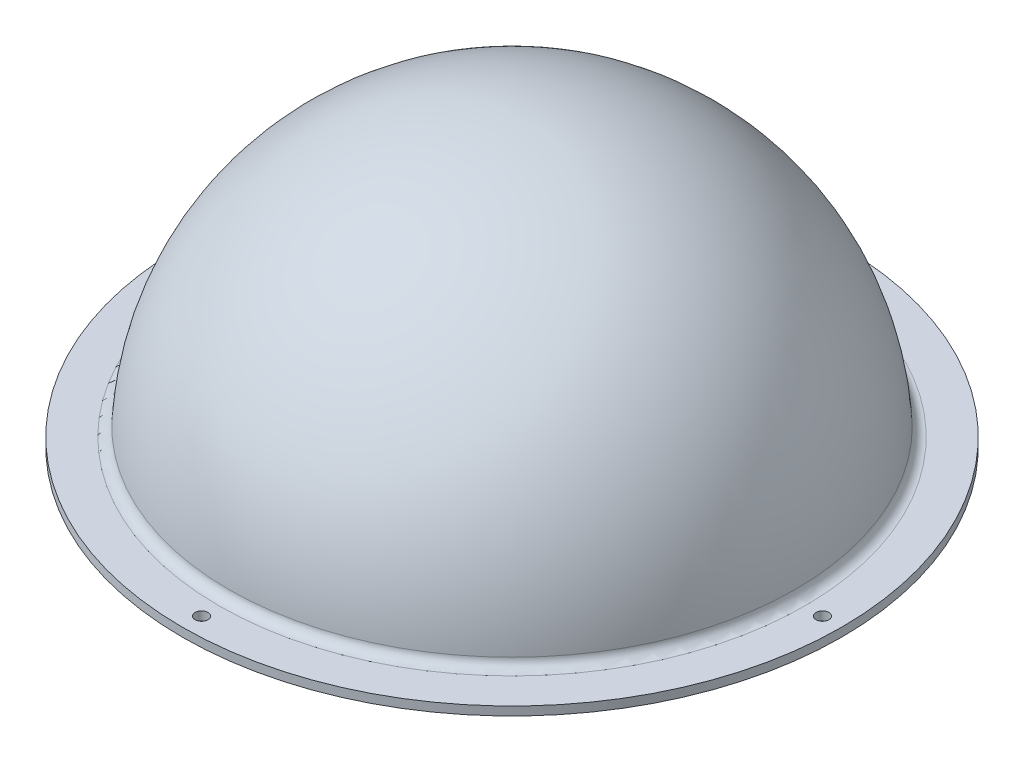
ISO-10303-21;
HEADER;
FILE_DESCRIPTION(('STEP AP214'),'2;1');
FILE_NAME('part.step','',(''),(''),'','','');
FILE_SCHEMA(('AUTOMOTIVE_DESIGN { 1 0 10303 214 1 1 1 1 }'));
ENDSEC;
DATA;
#1=APPLICATION_CONTEXT('core data for automotive mechanical design processes');
#2=APPLICATION_PROTOCOL_DEFINITION('international standard','automotive_design',2000,#1);
#3=PRODUCT_CONTEXT('',#1,'mechanical');
#4=PRODUCT('Part','Part','',(#3));
#5=PRODUCT_RELATED_PRODUCT_CATEGORY('part','',(#4));
#6=PRODUCT_DEFINITION_FORMATION('','',#4);
#7=PRODUCT_DEFINITION_CONTEXT('part definition',#1,'design');
#8=PRODUCT_DEFINITION('design','',#6,#7);
#9=PRODUCT_DEFINITION_SHAPE('','',#8);
#10=(LENGTH_UNIT() NAMED_UNIT(*) SI_UNIT(.MILLI.,.METRE.));
#11=(NAMED_UNIT(*) PLANE_ANGLE_UNIT() SI_UNIT($,.RADIAN.));
#12=(NAMED_UNIT(*) SI_UNIT($,.STERADIAN.) SOLID_ANGLE_UNIT());
#13=UNCERTAINTY_MEASURE_WITH_UNIT(LENGTH_MEASURE(1.E-05),#10,'distance_accuracy_value','');
#14=(GEOMETRIC_REPRESENTATION_CONTEXT(3) GLOBAL_UNCERTAINTY_ASSIGNED_CONTEXT((#13)) GLOBAL_UNIT_ASSIGNED_CONTEXT((#10,
#11,#12)) REPRESENTATION_CONTEXT('',''));
#15=CARTESIAN_POINT('',(0.,0.,0.));
#16=DIRECTION('',(0.,0.,1.));
#17=DIRECTION('',(1.,0.,0.));
#18=AXIS2_PLACEMENT_3D('',#15,#16,#17);
#19=CARTESIAN_POINT('',(0.,0.,0.));
#20=DIRECTION('',(0.,-1.,0.));
#21=DIRECTION('',(0.,0.,-1.));
#22=AXIS2_PLACEMENT_3D('',#19,#20,#21);
#23=PLANE('',#22);
#24=CARTESIAN_POINT('',(0.,0.,0.));
#25=DIRECTION('',(0.,-1.,0.));
#26=DIRECTION('',(0.,0.,-1.));
#27=AXIS2_PLACEMENT_3D('',#24,#25,#26);
#28=CIRCLE('',#27,72.8894502303317);
#29=CARTESIAN_POINT('',(0.,0.,-72.8894502303317));
#30=VERTEX_POINT('',#29);
#31=EDGE_CURVE('E47',#30,#30,#28,.F.);
#32=ORIENTED_EDGE('',*,*,#31,.T.);
#33=EDGE_LOOP('',(#32));
#34=FACE_BOUND('',#33,.T.);
#35=CARTESIAN_POINT('',(0.,0.,-79.97825));
#36=DIRECTION('',(0.,-1.,0.));
#37=DIRECTION('',(0.,0.,-1.));
#38=AXIS2_PLACEMENT_3D('',#35,#36,#37);
#39=CIRCLE('',#38,1.651);
#40=CARTESIAN_POINT('',(0.,0.,-81.62925));
#41=VERTEX_POINT('',#40);
#42=EDGE_CURVE('E62',#41,#41,#39,.F.);
#43=ORIENTED_EDGE('',*,*,#42,.T.);
#44=EDGE_LOOP('',(#43));
#45=FACE_BOUND('',#44,.T.);
#46=CARTESIAN_POINT('',(79.97825,0.,2.79242567388331E-13));
#47=DIRECTION('',(0.,-1.,0.));
#48=DIRECTION('',(0.,0.,-1.));
#49=AXIS2_PLACEMENT_3D('',#46,#47,#48);
#50=CIRCLE('',#49,1.651);
#51=CARTESIAN_POINT('',(79.97825,0.,-1.65099999999972));
#52=VERTEX_POINT('',#51);
#53=EDGE_CURVE('E76',#52,#52,#50,.F.);
#54=ORIENTED_EDGE('',*,*,#53,.T.);
#55=EDGE_LOOP('',(#54));
#56=FACE_BOUND('',#55,.T.);
#57=CARTESIAN_POINT('',(2.24373504989304E-12,0.,79.97825));
#58=DIRECTION('',(0.,-1.,0.));
#59=DIRECTION('',(0.,0.,-1.));
#60=AXIS2_PLACEMENT_3D('',#57,#58,#59);
#61=CIRCLE('',#60,1.65100000000268);
#62=CARTESIAN_POINT('',(2.24373504989304E-12,0.,78.3272499999973));
#63=VERTEX_POINT('',#62);
#64=EDGE_CURVE('E70',#63,#63,#61,.F.);
#65=ORIENTED_EDGE('',*,*,#64,.T.);
#66=EDGE_LOOP('',(#65));
#67=FACE_BOUND('',#66,.T.);
#68=CARTESIAN_POINT('',(-79.9782499999989,0.,1.13166203573291E-12));
#69=DIRECTION('',(0.,-1.,0.));
#70=DIRECTION('',(0.,0.,-1.));
#71=AXIS2_PLACEMENT_3D('',#68,#69,#70);
#72=CIRCLE('',#71,1.6510000000022);
#73=CARTESIAN_POINT('',(-79.9782499999989,0.,-1.65100000000107));
#74=VERTEX_POINT('',#73);
#75=EDGE_CURVE('E63',#74,#74,#72,.F.);
#76=ORIENTED_EDGE('',*,*,#75,.T.);
#77=EDGE_LOOP('',(#76));
#78=FACE_BOUND('',#77,.T.);
#79=CARTESIAN_POINT('',(0.,0.,0.));
#80=DIRECTION('',(0.,-1.,0.));
#81=DIRECTION('',(0.,0.,-1.));
#82=AXIS2_PLACEMENT_3D('',#79,#80,#81);
#83=CIRCLE('',#82,84.93125);
#84=CARTESIAN_POINT('',(0.,0.,-84.93125));
#85=VERTEX_POINT('',#84);
#86=EDGE_CURVE('E59',#85,#85,#83,.T.);
#87=ORIENTED_EDGE('',*,*,#86,.T.);
#88=EDGE_LOOP('',(#87));
#89=FACE_BOUND('',#88,.T.);
#90=ADVANCED_FACE('F36',(#34,#45,#56,#67,#78,#89),#23,.T.);
#91=CARTESIAN_POINT('',(0.,-0.0352884104772161,0.));
#92=DIRECTION('',(0.,-1.,0.));
#93=DIRECTION('',(1.,0.,0.));
#94=AXIS2_PLACEMENT_3D('',#91,#92,#93);
#95=SPHERICAL_SURFACE('',#94,73.0602884104772);
#96=CARTESIAN_POINT('',(0.,4.61357838691473,0.));
#97=DIRECTION('',(0.,-1.,0.));
#98=DIRECTION('',(0.,0.,-1.));
#99=AXIS2_PLACEMENT_3D('',#96,#97,#98);
#100=CIRCLE('',#99,72.9122334051167);
#101=CARTESIAN_POINT('',(0.,4.61357838691473,-72.9122334051167));
#102=VERTEX_POINT('',#101);
#103=EDGE_CURVE('E10',#102,#102,#100,.F.);
#104=ORIENTED_EDGE('',*,*,#103,.T.);
#105=EDGE_LOOP('',(#104));
#106=FACE_BOUND('',#105,.T.);
#107=ADVANCED_FACE('F94',(#106),#95,.T.);
#108=CARTESIAN_POINT('',(84.93125,2.23519999999999,0.));
#109=DIRECTION('',(0.,1.,0.));
#110=DIRECTION('',(0.,0.,1.));
#111=AXIS2_PLACEMENT_3D('',#108,#109,#110);
#112=PLANE('',#111);
#113=CARTESIAN_POINT('',(0.,2.23519999999999,0.));
#114=DIRECTION('',(0.,1.,0.));
#115=DIRECTION('',(0.,0.,1.));
#116=AXIS2_PLACEMENT_3D('',#113,#114,#115);
#117=CIRCLE('',#116,75.4470861531444);
#118=CARTESIAN_POINT('',(0.,2.23519999999999,75.4470861531444));
#119=VERTEX_POINT('',#118);
#120=EDGE_CURVE('E43',#119,#119,#117,.F.);
#121=ORIENTED_EDGE('',*,*,#120,.T.);
#122=EDGE_LOOP('',(#121));
#123=FACE_BOUND('',#122,.T.);
#124=CARTESIAN_POINT('',(0.,2.23519999999999,-79.97825));
#125=DIRECTION('',(0.,1.,0.));
#126=DIRECTION('',(0.,0.,1.));
#127=AXIS2_PLACEMENT_3D('',#124,#125,#126);
#128=CIRCLE('',#127,1.651);
#129=CARTESIAN_POINT('',(0.,2.23519999999999,-78.32725));
#130=VERTEX_POINT('',#129);
#131=EDGE_CURVE('E79',#130,#130,#128,.T.);
#132=ORIENTED_EDGE('',*,*,#131,.F.);
#133=EDGE_LOOP('',(#132));
#134=FACE_BOUND('',#133,.T.);
#135=CARTESIAN_POINT('',(79.97825,2.23519999999999,2.79242567388331E-13));
#136=DIRECTION('',(0.,1.,0.));
#137=DIRECTION('',(0.,0.,1.));
#138=AXIS2_PLACEMENT_3D('',#135,#136,#137);
#139=CIRCLE('',#138,1.651);
#140=CARTESIAN_POINT('',(79.97825,2.23519999999999,1.65100000000028));
#141=VERTEX_POINT('',#140);
#142=EDGE_CURVE('E73',#141,#141,#139,.T.);
#143=ORIENTED_EDGE('',*,*,#142,.F.);
#144=EDGE_LOOP('',(#143));
#145=FACE_BOUND('',#144,.T.);
#146=CARTESIAN_POINT('',(2.24373504989304E-12,2.23519999999999,79.97825));
#147=DIRECTION('',(0.,1.,0.));
#148=DIRECTION('',(0.,0.,1.));
#149=AXIS2_PLACEMENT_3D('',#146,#147,#148);
#150=CIRCLE('',#149,1.65100000000268);
#151=CARTESIAN_POINT('',(2.24373504989304E-12,2.23519999999999,81.6292500000027));
#152=VERTEX_POINT('',#151);
#153=EDGE_CURVE('E66',#152,#152,#150,.T.);
#154=ORIENTED_EDGE('',*,*,#153,.F.);
#155=EDGE_LOOP('',(#154));
#156=FACE_BOUND('',#155,.T.);
#157=CARTESIAN_POINT('',(-79.9782499999989,2.23519999999999,1.13166203573291E-12));
#158=DIRECTION('',(0.,1.,0.));
#159=DIRECTION('',(0.,0.,1.));
#160=AXIS2_PLACEMENT_3D('',#157,#158,#159);
#161=CIRCLE('',#160,1.6510000000022);
#162=CARTESIAN_POINT('',(-79.9782499999989,2.23519999999999,1.65100000000334));
#163=VERTEX_POINT('',#162);
#164=EDGE_CURVE('E67',#163,#163,#161,.T.);
#165=ORIENTED_EDGE('',*,*,#164,.F.);
#166=EDGE_LOOP('',(#165));
#167=FACE_BOUND('',#166,.T.);
#168=CARTESIAN_POINT('',(0.,2.23519999999999,0.));
#169=DIRECTION('',(0.,-1.,0.));
#170=DIRECTION('',(0.,0.,-1.));
#171=AXIS2_PLACEMENT_3D('',#168,#169,#170);
#172=CIRCLE('',#171,84.93125);
#173=CARTESIAN_POINT('',(0.,2.23519999999999,-84.93125));
#174=VERTEX_POINT('',#173);
#175=EDGE_CURVE('E56',#174,#174,#172,.T.);
#176=ORIENTED_EDGE('',*,*,#175,.F.);
#177=EDGE_LOOP('',(#176));
#178=FACE_BOUND('',#177,.T.);
#179=ADVANCED_FACE('F90',(#123,#134,#145,#156,#167,#178),#112,.T.);
#180=CARTESIAN_POINT('',(0.,0.,0.));
#181=DIRECTION('',(0.,-1.,0.));
#182=DIRECTION('',(0.,0.,-1.));
#183=AXIS2_PLACEMENT_3D('',#180,#181,#182);
#184=CYLINDRICAL_SURFACE('',#183,84.93125);
#185=ORIENTED_EDGE('',*,*,#175,.T.);
#186=EDGE_LOOP('',(#185));
#187=FACE_BOUND('',#186,.T.);
#188=ORIENTED_EDGE('',*,*,#86,.F.);
#189=EDGE_LOOP('',(#188));
#190=FACE_BOUND('',#189,.T.);
#191=ADVANCED_FACE('F93',(#187,#190),#184,.T.);
#192=CARTESIAN_POINT('',(0.,-0.0352884104772161,0.));
#193=DIRECTION('',(0.,-1.,0.));
#194=DIRECTION('',(1.,0.,0.));
#195=AXIS2_PLACEMENT_3D('',#192,#193,#194);
#196=SPHERICAL_SURFACE('',#195,70.8250884104772);
#197=CARTESIAN_POINT('',(0.,2.03426808715502,0.));
#198=DIRECTION('',(0.,-1.,0.));
#199=DIRECTION('',(0.,0.,-1.));
#200=AXIS2_PLACEMENT_3D('',#197,#198,#199);
#201=CIRCLE('',#200,70.794845040123);
#202=CARTESIAN_POINT('',(0.,2.03426808715502,-70.794845040123));
#203=VERTEX_POINT('',#202);
#204=EDGE_CURVE('E51',#203,#203,#201,.T.);
#205=ORIENTED_EDGE('',*,*,#204,.T.);
#206=EDGE_LOOP('',(#205));
#207=FACE_BOUND('',#206,.T.);
#208=ADVANCED_FACE('F106',(#207),#196,.F.);
#209=CARTESIAN_POINT('',(-79.9782499999989,-4.66973318296353,1.13166203573291E-12));
#210=DIRECTION('',(0.,1.,0.));
#211=DIRECTION('',(0.,0.,1.));
#212=AXIS2_PLACEMENT_3D('',#209,#210,#211);
#213=CYLINDRICAL_SURFACE('',#212,1.6510000000022);
#214=ORIENTED_EDGE('',*,*,#164,.T.);
#215=EDGE_LOOP('',(#214));
#216=FACE_BOUND('',#215,.T.);
#217=ORIENTED_EDGE('',*,*,#75,.F.);
#218=EDGE_LOOP('',(#217));
#219=FACE_BOUND('',#218,.T.);
#220=ADVANCED_FACE('F133',(#216,#219),#213,.F.);
#221=CARTESIAN_POINT('',(2.24373504989304E-12,-4.66973318296353,79.97825));
#222=DIRECTION('',(0.,1.,0.));
#223=DIRECTION('',(0.,0.,1.));
#224=AXIS2_PLACEMENT_3D('',#221,#222,#223);
#225=CYLINDRICAL_SURFACE('',#224,1.65100000000268);
#226=ORIENTED_EDGE('',*,*,#153,.T.);
#227=EDGE_LOOP('',(#226));
#228=FACE_BOUND('',#227,.T.);
#229=ORIENTED_EDGE('',*,*,#64,.F.);
#230=EDGE_LOOP('',(#229));
#231=FACE_BOUND('',#230,.T.);
#232=ADVANCED_FACE('F138',(#228,#231),#225,.F.);
#233=CARTESIAN_POINT('',(79.97825,-4.66973318296353,2.79242567388331E-13));
#234=DIRECTION('',(0.,1.,0.));
#235=DIRECTION('',(0.,0.,1.));
#236=AXIS2_PLACEMENT_3D('',#233,#234,#235);
#237=CYLINDRICAL_SURFACE('',#236,1.651);
#238=ORIENTED_EDGE('',*,*,#142,.T.);
#239=EDGE_LOOP('',(#238));
#240=FACE_BOUND('',#239,.T.);
#241=ORIENTED_EDGE('',*,*,#53,.F.);
#242=EDGE_LOOP('',(#241));
#243=FACE_BOUND('',#242,.T.);
#244=ADVANCED_FACE('F126',(#240,#243),#237,.F.);
#245=CARTESIAN_POINT('',(0.,-4.66973318296353,-79.97825));
#246=DIRECTION('',(0.,1.,0.));
#247=DIRECTION('',(0.,0.,1.));
#248=AXIS2_PLACEMENT_3D('',#245,#246,#247);
#249=CYLINDRICAL_SURFACE('',#248,1.651);
#250=ORIENTED_EDGE('',*,*,#131,.T.);
#251=EDGE_LOOP('',(#250));
#252=FACE_BOUND('',#251,.T.);
#253=ORIENTED_EDGE('',*,*,#42,.F.);
#254=EDGE_LOOP('',(#253));
#255=FACE_BOUND('',#254,.T.);
#256=ADVANCED_FACE('F87',(#252,#255),#249,.F.);
#257=CARTESIAN_POINT('',(0.,2.0955,0.));
#258=DIRECTION('',(0.,-1.,0.));
#259=DIRECTION('',(0.,0.,-1.));
#260=AXIS2_PLACEMENT_3D('',#257,#258,#259);
#261=TOROIDAL_SURFACE('',#260,72.8894502303317,2.0955);
#262=ORIENTED_EDGE('',*,*,#31,.F.);
#263=EDGE_LOOP('',(#262));
#264=FACE_BOUND('',#263,.T.);
#265=ORIENTED_EDGE('',*,*,#204,.F.);
#266=EDGE_LOOP('',(#265));
#267=FACE_BOUND('',#266,.T.);
#268=ADVANCED_FACE('F118',(#264,#267),#261,.T.);
#269=CARTESIAN_POINT('',(0.,4.77519999999999,0.));
#270=DIRECTION('',(0.,1.,0.));
#271=DIRECTION('',(0.,0.,1.));
#272=AXIS2_PLACEMENT_3D('',#269,#270,#271);
#273=TOROIDAL_SURFACE('',#272,75.4470861531444,2.54);
#274=ORIENTED_EDGE('',*,*,#103,.F.);
#275=EDGE_LOOP('',(#274));
#276=FACE_BOUND('',#275,.T.);
#277=ORIENTED_EDGE('',*,*,#120,.F.);
#278=EDGE_LOOP('',(#277));
#279=FACE_BOUND('',#278,.T.);
#280=ADVANCED_FACE('F38',(#276,#279),#273,.F.);
#281=CLOSED_SHELL('',(#90,#107,#179,#191,#208,#220,#232,#244,#256,#268,#280));
#282=MANIFOLD_SOLID_BREP('B2',#281);
#283=ADVANCED_BREP_SHAPE_REPRESENTATION('',(#18,#282),#14);
#284=SHAPE_DEFINITION_REPRESENTATION(#9,#283);
ENDSEC;
END-ISO-10303-21;
